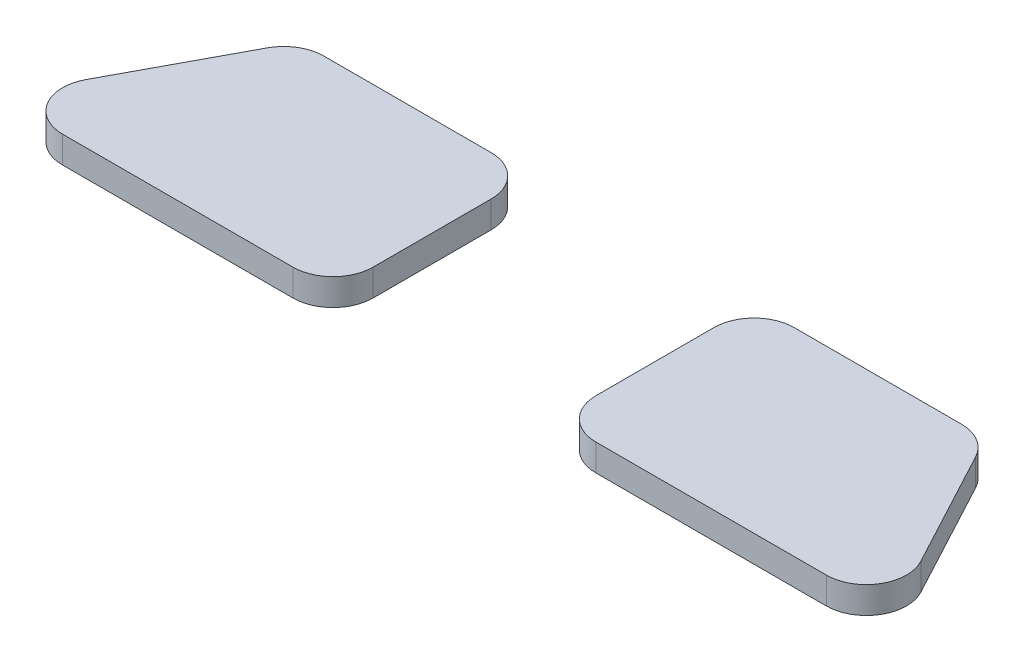
ISO-10303-21;
HEADER;
FILE_DESCRIPTION(('STEP AP214'),'2;1');
FILE_NAME('part.step','',(''),(''),'','','');
FILE_SCHEMA(('AUTOMOTIVE_DESIGN { 1 0 10303 214 1 1 1 1 }'));
ENDSEC;
DATA;
#1=APPLICATION_CONTEXT('core data for automotive mechanical design processes');
#2=APPLICATION_PROTOCOL_DEFINITION('international standard','automotive_design',2000,#1);
#3=PRODUCT_CONTEXT('',#1,'mechanical');
#4=PRODUCT('Part','Part','',(#3));
#5=PRODUCT_RELATED_PRODUCT_CATEGORY('part','',(#4));
#6=PRODUCT_DEFINITION_FORMATION('','',#4);
#7=PRODUCT_DEFINITION_CONTEXT('part definition',#1,'design');
#8=PRODUCT_DEFINITION('design','',#6,#7);
#9=PRODUCT_DEFINITION_SHAPE('','',#8);
#10=(LENGTH_UNIT() NAMED_UNIT(*) SI_UNIT(.MILLI.,.METRE.));
#11=(NAMED_UNIT(*) PLANE_ANGLE_UNIT() SI_UNIT($,.RADIAN.));
#12=(NAMED_UNIT(*) SI_UNIT($,.STERADIAN.) SOLID_ANGLE_UNIT());
#13=UNCERTAINTY_MEASURE_WITH_UNIT(LENGTH_MEASURE(1.E-05),#10,'distance_accuracy_value','');
#14=(GEOMETRIC_REPRESENTATION_CONTEXT(3) GLOBAL_UNCERTAINTY_ASSIGNED_CONTEXT((#13)) GLOBAL_UNIT_ASSIGNED_CONTEXT((#10,
#11,#12)) REPRESENTATION_CONTEXT('',''));
#15=CARTESIAN_POINT('',(0.,0.,0.));
#16=DIRECTION('',(0.,0.,1.));
#17=DIRECTION('',(1.,0.,0.));
#18=AXIS2_PLACEMENT_3D('',#15,#16,#17);
#19=CARTESIAN_POINT('',(36.9297716522194,2.,3.));
#20=DIRECTION('',(0.,-1.,0.));
#21=DIRECTION('',(0.,0.,-1.));
#22=AXIS2_PLACEMENT_3D('',#19,#20,#21);
#23=CYLINDRICAL_SURFACE('',#22,3.);
#24=CARTESIAN_POINT('',(36.9297716522194,0.,3.));
#25=DIRECTION('',(0.,1.,0.));
#26=DIRECTION('',(0.,0.,1.));
#27=AXIS2_PLACEMENT_3D('',#24,#25,#26);
#28=CIRCLE('',#27,3.);
#29=CARTESIAN_POINT('',(36.9297716522194,0.,0.));
#30=VERTEX_POINT('',#29);
#31=CARTESIAN_POINT('',(33.9297716522194,0.,3.00000000000002));
#32=VERTEX_POINT('',#31);
#33=EDGE_CURVE('E12',#30,#32,#28,.T.);
#34=ORIENTED_EDGE('',*,*,#33,.T.);
#35=DIRECTION('',(0.,-1.,0.));
#36=VECTOR('',#35,1.);
#37=CARTESIAN_POINT('',(33.9297716522194,2.,3.00000000000002));
#38=LINE('',#37,#36);
#39=CARTESIAN_POINT('',(33.9297716522194,2.,3.00000000000002));
#40=VERTEX_POINT('',#39);
#41=EDGE_CURVE('E185',#40,#32,#38,.T.);
#42=ORIENTED_EDGE('',*,*,#41,.F.);
#43=CARTESIAN_POINT('',(36.9297716522194,2.,3.));
#44=DIRECTION('',(0.,1.,0.));
#45=DIRECTION('',(0.,0.,1.));
#46=AXIS2_PLACEMENT_3D('',#43,#44,#45);
#47=CIRCLE('',#46,3.);
#48=CARTESIAN_POINT('',(36.9297716522194,2.,0.));
#49=VERTEX_POINT('',#48);
#50=EDGE_CURVE('E53',#49,#40,#47,.T.);
#51=ORIENTED_EDGE('',*,*,#50,.F.);
#52=DIRECTION('',(0.,-1.,0.));
#53=VECTOR('',#52,1.);
#54=CARTESIAN_POINT('',(36.9297716522194,2.,0.));
#55=LINE('',#54,#53);
#56=EDGE_CURVE('E153',#49,#30,#55,.T.);
#57=ORIENTED_EDGE('',*,*,#56,.T.);
#58=EDGE_LOOP('',(#34,#42,#51,#57));
#59=FACE_BOUND('',#58,.T.);
#60=ADVANCED_FACE('F49',(#59),#23,.T.);
#61=CARTESIAN_POINT('',(33.9297716522194,2.,3.00000000000002));
#62=DIRECTION('',(1.,0.,0.));
#63=DIRECTION('',(0.,0.,-1.));
#64=AXIS2_PLACEMENT_3D('',#61,#62,#63);
#65=PLANE('',#64);
#66=DIRECTION('',(0.,0.,1.));
#67=VECTOR('',#66,1.);
#68=CARTESIAN_POINT('',(33.9297716522194,0.,3.00000000000002));
#69=LINE('',#68,#67);
#70=CARTESIAN_POINT('',(33.9297716522194,0.,11.81));
#71=VERTEX_POINT('',#70);
#72=EDGE_CURVE('E59',#32,#71,#69,.T.);
#73=ORIENTED_EDGE('',*,*,#72,.T.);
#74=DIRECTION('',(0.,-1.,0.));
#75=VECTOR('',#74,1.);
#76=CARTESIAN_POINT('',(33.9297716522194,2.,11.81));
#77=LINE('',#76,#75);
#78=CARTESIAN_POINT('',(33.9297716522194,2.,11.81));
#79=VERTEX_POINT('',#78);
#80=EDGE_CURVE('E129',#79,#71,#77,.T.);
#81=ORIENTED_EDGE('',*,*,#80,.F.);
#82=DIRECTION('',(0.,0.,1.));
#83=VECTOR('',#82,1.);
#84=CARTESIAN_POINT('',(33.9297716522194,2.,3.00000000000002));
#85=LINE('',#84,#83);
#86=EDGE_CURVE('E95',#40,#79,#85,.T.);
#87=ORIENTED_EDGE('',*,*,#86,.F.);
#88=ORIENTED_EDGE('',*,*,#41,.T.);
#89=EDGE_LOOP('',(#73,#81,#87,#88));
#90=FACE_BOUND('',#89,.T.);
#91=ADVANCED_FACE('F191',(#90),#65,.F.);
#92=CARTESIAN_POINT('',(36.9297716522194,2.,11.81));
#93=DIRECTION('',(0.,-1.,0.));
#94=DIRECTION('',(0.,0.,-1.));
#95=AXIS2_PLACEMENT_3D('',#92,#93,#94);
#96=CYLINDRICAL_SURFACE('',#95,3.);
#97=CARTESIAN_POINT('',(36.9297716522194,0.,11.81));
#98=DIRECTION('',(0.,1.,0.));
#99=DIRECTION('',(0.,0.,1.));
#100=AXIS2_PLACEMENT_3D('',#97,#98,#99);
#101=CIRCLE('',#100,3.);
#102=CARTESIAN_POINT('',(36.9297716522194,0.,14.81));
#103=VERTEX_POINT('',#102);
#104=EDGE_CURVE('E123',#71,#103,#101,.T.);
#105=ORIENTED_EDGE('',*,*,#104,.T.);
#106=DIRECTION('',(0.,-1.,0.));
#107=VECTOR('',#106,1.);
#108=CARTESIAN_POINT('',(36.9297716522194,2.,14.81));
#109=LINE('',#108,#107);
#110=CARTESIAN_POINT('',(36.9297716522194,2.,14.81));
#111=VERTEX_POINT('',#110);
#112=EDGE_CURVE('E127',#111,#103,#109,.T.);
#113=ORIENTED_EDGE('',*,*,#112,.F.);
#114=CARTESIAN_POINT('',(36.9297716522194,2.,11.81));
#115=DIRECTION('',(0.,1.,0.));
#116=DIRECTION('',(0.,0.,1.));
#117=AXIS2_PLACEMENT_3D('',#114,#115,#116);
#118=CIRCLE('',#117,3.);
#119=EDGE_CURVE('E160',#79,#111,#118,.T.);
#120=ORIENTED_EDGE('',*,*,#119,.F.);
#121=ORIENTED_EDGE('',*,*,#80,.T.);
#122=EDGE_LOOP('',(#105,#113,#120,#121));
#123=FACE_BOUND('',#122,.T.);
#124=ADVANCED_FACE('F125',(#123),#96,.T.);
#125=CARTESIAN_POINT('',(36.9297716522194,2.,14.81));
#126=DIRECTION('',(0.,0.,-1.));
#127=DIRECTION('',(-1.,0.,0.));
#128=AXIS2_PLACEMENT_3D('',#125,#126,#127);
#129=PLANE('',#128);
#130=DIRECTION('',(1.,0.,0.));
#131=VECTOR('',#130,1.);
#132=CARTESIAN_POINT('',(36.9297716522194,0.,14.81));
#133=LINE('',#132,#131);
#134=CARTESIAN_POINT('',(54.1334145088564,0.,14.81));
#135=VERTEX_POINT('',#134);
#136=EDGE_CURVE('E131',#103,#135,#133,.T.);
#137=ORIENTED_EDGE('',*,*,#136,.T.);
#138=DIRECTION('',(0.,-1.,0.));
#139=VECTOR('',#138,1.);
#140=CARTESIAN_POINT('',(54.1334145088564,2.,14.81));
#141=LINE('',#140,#139);
#142=CARTESIAN_POINT('',(54.1334145088564,2.,14.81));
#143=VERTEX_POINT('',#142);
#144=EDGE_CURVE('E138',#143,#135,#141,.T.);
#145=ORIENTED_EDGE('',*,*,#144,.F.);
#146=DIRECTION('',(1.,0.,0.));
#147=VECTOR('',#146,1.);
#148=CARTESIAN_POINT('',(36.9297716522194,2.,14.81));
#149=LINE('',#148,#147);
#150=EDGE_CURVE('E137',#111,#143,#149,.T.);
#151=ORIENTED_EDGE('',*,*,#150,.F.);
#152=ORIENTED_EDGE('',*,*,#112,.T.);
#153=EDGE_LOOP('',(#137,#145,#151,#152));
#154=FACE_BOUND('',#153,.T.);
#155=ADVANCED_FACE('F134',(#154),#129,.F.);
#156=CARTESIAN_POINT('',(54.1334145088564,2.,11.81));
#157=DIRECTION('',(0.,-1.,0.));
#158=DIRECTION('',(0.,0.,-1.));
#159=AXIS2_PLACEMENT_3D('',#156,#157,#158);
#160=CYLINDRICAL_SURFACE('',#159,3.);
#161=CARTESIAN_POINT('',(54.1334145088564,0.,11.81));
#162=DIRECTION('',(0.,1.,0.));
#163=DIRECTION('',(0.,0.,1.));
#164=AXIS2_PLACEMENT_3D('',#161,#162,#163);
#165=CIRCLE('',#164,3.);
#166=CARTESIAN_POINT('',(56.7788893629486,0.,10.3952693555429));
#167=VERTEX_POINT('',#166);
#168=EDGE_CURVE('E143',#135,#167,#165,.T.);
#169=ORIENTED_EDGE('',*,*,#168,.T.);
#170=DIRECTION('',(0.,-1.,0.));
#171=VECTOR('',#170,1.);
#172=CARTESIAN_POINT('',(56.7788893629486,2.,10.3952693555429));
#173=LINE('',#172,#171);
#174=CARTESIAN_POINT('',(56.7788893629486,2.,10.3952693555429));
#175=VERTEX_POINT('',#174);
#176=EDGE_CURVE('E177',#175,#167,#173,.T.);
#177=ORIENTED_EDGE('',*,*,#176,.F.);
#178=CARTESIAN_POINT('',(54.1334145088564,2.,11.81));
#179=DIRECTION('',(0.,1.,0.));
#180=DIRECTION('',(0.,0.,1.));
#181=AXIS2_PLACEMENT_3D('',#178,#179,#180);
#182=CIRCLE('',#181,3.);
#183=EDGE_CURVE('E157',#143,#175,#182,.T.);
#184=ORIENTED_EDGE('',*,*,#183,.F.);
#185=ORIENTED_EDGE('',*,*,#144,.T.);
#186=EDGE_LOOP('',(#169,#177,#184,#185));
#187=FACE_BOUND('',#186,.T.);
#188=ADVANCED_FACE('F194',(#187),#160,.T.);
#189=CARTESIAN_POINT('',(52.0675321718615,2.,1.58526935554289));
#190=DIRECTION('',(-0.881824951364054,0.,0.471576881485706));
#191=DIRECTION('',(0.471576881485706,0.,0.881824951364054));
#192=AXIS2_PLACEMENT_3D('',#189,#190,#191);
#193=PLANE('',#192);
#194=DIRECTION('',(-0.471576881485706,0.,-0.881824951364054));
#195=VECTOR('',#194,1.);
#196=CARTESIAN_POINT('',(52.0675321718615,0.,1.58526935554289));
#197=LINE('',#196,#195);
#198=CARTESIAN_POINT('',(52.0675321718615,0.,1.58526935554289));
#199=VERTEX_POINT('',#198);
#200=EDGE_CURVE('E145',#167,#199,#197,.T.);
#201=ORIENTED_EDGE('',*,*,#200,.T.);
#202=DIRECTION('',(0.,-1.,0.));
#203=VECTOR('',#202,1.);
#204=CARTESIAN_POINT('',(52.0675321718615,2.,1.58526935554289));
#205=LINE('',#204,#203);
#206=CARTESIAN_POINT('',(52.0675321718615,2.,1.58526935554289));
#207=VERTEX_POINT('',#206);
#208=EDGE_CURVE('E174',#207,#199,#205,.T.);
#209=ORIENTED_EDGE('',*,*,#208,.F.);
#210=DIRECTION('',(-0.471576881485706,0.,-0.881824951364054));
#211=VECTOR('',#210,1.);
#212=CARTESIAN_POINT('',(52.0675321718615,2.,1.58526935554289));
#213=LINE('',#212,#211);
#214=EDGE_CURVE('E155',#175,#207,#213,.T.);
#215=ORIENTED_EDGE('',*,*,#214,.F.);
#216=ORIENTED_EDGE('',*,*,#176,.T.);
#217=EDGE_LOOP('',(#201,#209,#215,#216));
#218=FACE_BOUND('',#217,.T.);
#219=ADVANCED_FACE('F172',(#218),#193,.F.);
#220=CARTESIAN_POINT('',(49.4220573177693,2.,3.));
#221=DIRECTION('',(0.,-1.,0.));
#222=DIRECTION('',(0.,0.,-1.));
#223=AXIS2_PLACEMENT_3D('',#220,#221,#222);
#224=CYLINDRICAL_SURFACE('',#223,3.);
#225=CARTESIAN_POINT('',(49.4220573177693,0.,3.));
#226=DIRECTION('',(0.,1.,0.));
#227=DIRECTION('',(0.,0.,-1.));
#228=AXIS2_PLACEMENT_3D('',#225,#226,#227);
#229=CIRCLE('',#228,3.);
#230=CARTESIAN_POINT('',(49.4220573177693,0.,0.));
#231=VERTEX_POINT('',#230);
#232=EDGE_CURVE('E163',#199,#231,#229,.T.);
#233=ORIENTED_EDGE('',*,*,#232,.T.);
#234=DIRECTION('',(0.,-1.,0.));
#235=VECTOR('',#234,1.);
#236=CARTESIAN_POINT('',(49.4220573177693,2.,0.));
#237=LINE('',#236,#235);
#238=CARTESIAN_POINT('',(49.4220573177693,2.,0.));
#239=VERTEX_POINT('',#238);
#240=EDGE_CURVE('E182',#239,#231,#237,.T.);
#241=ORIENTED_EDGE('',*,*,#240,.F.);
#242=CARTESIAN_POINT('',(49.4220573177693,2.,3.));
#243=DIRECTION('',(0.,1.,0.));
#244=DIRECTION('',(0.,0.,-1.));
#245=AXIS2_PLACEMENT_3D('',#242,#243,#244);
#246=CIRCLE('',#245,3.);
#247=EDGE_CURVE('E152',#207,#239,#246,.T.);
#248=ORIENTED_EDGE('',*,*,#247,.F.);
#249=ORIENTED_EDGE('',*,*,#208,.T.);
#250=EDGE_LOOP('',(#233,#241,#248,#249));
#251=FACE_BOUND('',#250,.T.);
#252=ADVANCED_FACE('F180',(#251),#224,.T.);
#253=CARTESIAN_POINT('',(49.4220573177693,2.,0.));
#254=DIRECTION('',(0.,0.,1.));
#255=DIRECTION('',(1.,0.,0.));
#256=AXIS2_PLACEMENT_3D('',#253,#254,#255);
#257=PLANE('',#256);
#258=DIRECTION('',(-1.,0.,0.));
#259=VECTOR('',#258,1.);
#260=CARTESIAN_POINT('',(49.4220573177693,0.,0.));
#261=LINE('',#260,#259);
#262=EDGE_CURVE('E106',#231,#30,#261,.T.);
#263=ORIENTED_EDGE('',*,*,#262,.T.);
#264=ORIENTED_EDGE('',*,*,#56,.F.);
#265=DIRECTION('',(-1.,0.,0.));
#266=VECTOR('',#265,1.);
#267=CARTESIAN_POINT('',(49.4220573177693,2.,0.));
#268=LINE('',#267,#266);
#269=EDGE_CURVE('E150',#239,#49,#268,.T.);
#270=ORIENTED_EDGE('',*,*,#269,.F.);
#271=ORIENTED_EDGE('',*,*,#240,.T.);
#272=EDGE_LOOP('',(#263,#264,#270,#271));
#273=FACE_BOUND('',#272,.T.);
#274=ADVANCED_FACE('F195',(#273),#257,.F.);
#275=CARTESIAN_POINT('',(36.9297716522194,2.,3.));
#276=DIRECTION('',(0.,1.,0.));
#277=DIRECTION('',(0.,0.,1.));
#278=AXIS2_PLACEMENT_3D('',#275,#276,#277);
#279=PLANE('',#278);
#280=ORIENTED_EDGE('',*,*,#50,.T.);
#281=ORIENTED_EDGE('',*,*,#86,.T.);
#282=ORIENTED_EDGE('',*,*,#119,.T.);
#283=ORIENTED_EDGE('',*,*,#150,.T.);
#284=ORIENTED_EDGE('',*,*,#183,.T.);
#285=ORIENTED_EDGE('',*,*,#214,.T.);
#286=ORIENTED_EDGE('',*,*,#247,.T.);
#287=ORIENTED_EDGE('',*,*,#269,.T.);
#288=EDGE_LOOP('',(#280,#281,#282,#283,#284,#285,#286,#287));
#289=FACE_BOUND('',#288,.T.);
#290=ADVANCED_FACE('F51',(#289),#279,.T.);
#291=CARTESIAN_POINT('',(36.9297716522194,0.,3.));
#292=DIRECTION('',(0.,1.,0.));
#293=DIRECTION('',(0.,0.,1.));
#294=AXIS2_PLACEMENT_3D('',#291,#292,#293);
#295=PLANE('',#294);
#296=ORIENTED_EDGE('',*,*,#33,.F.);
#297=ORIENTED_EDGE('',*,*,#262,.F.);
#298=ORIENTED_EDGE('',*,*,#232,.F.);
#299=ORIENTED_EDGE('',*,*,#200,.F.);
#300=ORIENTED_EDGE('',*,*,#168,.F.);
#301=ORIENTED_EDGE('',*,*,#136,.F.);
#302=ORIENTED_EDGE('',*,*,#104,.F.);
#303=ORIENTED_EDGE('',*,*,#72,.F.);
#304=EDGE_LOOP('',(#296,#297,#298,#299,#300,#301,#302,#303));
#305=FACE_BOUND('',#304,.T.);
#306=ADVANCED_FACE('F141',(#305),#295,.F.);
#307=CLOSED_SHELL('',(#60,#91,#124,#155,#188,#219,#252,#274,#290,#306));
#308=MANIFOLD_SOLID_BREP('B2',#307);
#309=CARTESIAN_POINT('',(-2.91364285663705,2.,11.81));
#310=DIRECTION('',(0.,-1.,0.));
#311=DIRECTION('',(0.,0.,-1.));
#312=AXIS2_PLACEMENT_3D('',#309,#310,#311);
#313=CYLINDRICAL_SURFACE('',#312,3.);
#314=CARTESIAN_POINT('',(-2.91364285663705,0.,11.81));
#315=DIRECTION('',(0.,1.,0.));
#316=DIRECTION('',(0.,0.,-1.));
#317=AXIS2_PLACEMENT_3D('',#314,#315,#316);
#318=CIRCLE('',#317,3.);
#319=CARTESIAN_POINT('',(-5.55911771072919,0.,10.3952693555429));
#320=VERTEX_POINT('',#319);
#321=CARTESIAN_POINT('',(-2.91364285663701,0.,14.81));
#322=VERTEX_POINT('',#321);
#323=EDGE_CURVE('E393',#320,#322,#318,.T.);
#324=ORIENTED_EDGE('',*,*,#323,.T.);
#325=DIRECTION('',(0.,-1.,0.));
#326=VECTOR('',#325,1.);
#327=CARTESIAN_POINT('',(-2.91364285663701,2.,14.81));
#328=LINE('',#327,#326);
#329=CARTESIAN_POINT('',(-2.91364285663701,2.,14.81));
#330=VERTEX_POINT('',#329);
#331=EDGE_CURVE('E47',#330,#322,#328,.T.);
#332=ORIENTED_EDGE('',*,*,#331,.F.);
#333=CARTESIAN_POINT('',(-2.91364285663705,2.,11.81));
#334=DIRECTION('',(0.,1.,0.));
#335=DIRECTION('',(0.,0.,-1.));
#336=AXIS2_PLACEMENT_3D('',#333,#334,#335);
#337=CIRCLE('',#336,3.);
#338=CARTESIAN_POINT('',(-5.55911771072919,2.,10.3952693555429));
#339=VERTEX_POINT('',#338);
#340=EDGE_CURVE('E407',#339,#330,#337,.T.);
#341=ORIENTED_EDGE('',*,*,#340,.F.);
#342=DIRECTION('',(0.,-1.,0.));
#343=VECTOR('',#342,1.);
#344=CARTESIAN_POINT('',(-5.55911771072919,2.,10.3952693555429));
#345=LINE('',#344,#343);
#346=EDGE_CURVE('E389',#339,#320,#345,.T.);
#347=ORIENTED_EDGE('',*,*,#346,.T.);
#348=EDGE_LOOP('',(#324,#332,#341,#347));
#349=FACE_BOUND('',#348,.T.);
#350=ADVANCED_FACE('F297',(#349),#313,.T.);
#351=CARTESIAN_POINT('',(14.29,2.,14.81));
#352=DIRECTION('',(0.,0.,-1.));
#353=DIRECTION('',(-1.,0.,0.));
#354=AXIS2_PLACEMENT_3D('',#351,#352,#353);
#355=PLANE('',#354);
#356=DIRECTION('',(1.,0.,0.));
#357=VECTOR('',#356,1.);
#358=CARTESIAN_POINT('',(14.29,0.,14.81));
#359=LINE('',#358,#357);
#360=CARTESIAN_POINT('',(14.29,0.,14.81));
#361=VERTEX_POINT('',#360);
#362=EDGE_CURVE('E396',#322,#361,#359,.T.);
#363=ORIENTED_EDGE('',*,*,#362,.T.);
#364=DIRECTION('',(0.,-1.,0.));
#365=VECTOR('',#364,1.);
#366=CARTESIAN_POINT('',(14.29,2.,14.81));
#367=LINE('',#366,#365);
#368=CARTESIAN_POINT('',(14.29,2.,14.81));
#369=VERTEX_POINT('',#368);
#370=EDGE_CURVE('E305',#369,#361,#367,.T.);
#371=ORIENTED_EDGE('',*,*,#370,.F.);
#372=DIRECTION('',(1.,0.,0.));
#373=VECTOR('',#372,1.);
#374=CARTESIAN_POINT('',(14.29,2.,14.81));
#375=LINE('',#374,#373);
#376=EDGE_CURVE('E356',#330,#369,#375,.T.);
#377=ORIENTED_EDGE('',*,*,#376,.F.);
#378=ORIENTED_EDGE('',*,*,#331,.T.);
#379=EDGE_LOOP('',(#363,#371,#377,#378));
#380=FACE_BOUND('',#379,.T.);
#381=ADVANCED_FACE('F442',(#380),#355,.F.);
#382=CARTESIAN_POINT('',(14.29,2.,11.81));
#383=DIRECTION('',(0.,-1.,0.));
#384=DIRECTION('',(0.,0.,-1.));
#385=AXIS2_PLACEMENT_3D('',#382,#383,#384);
#386=CYLINDRICAL_SURFACE('',#385,3.);
#387=CARTESIAN_POINT('',(14.29,0.,11.81));
#388=DIRECTION('',(0.,1.,0.));
#389=DIRECTION('',(0.,0.,-1.));
#390=AXIS2_PLACEMENT_3D('',#387,#388,#389);
#391=CIRCLE('',#390,3.);
#392=CARTESIAN_POINT('',(17.29,0.,11.81));
#393=VERTEX_POINT('',#392);
#394=EDGE_CURVE('E398',#361,#393,#391,.T.);
#395=ORIENTED_EDGE('',*,*,#394,.T.);
#396=DIRECTION('',(0.,-1.,0.));
#397=VECTOR('',#396,1.);
#398=CARTESIAN_POINT('',(17.29,2.,11.81));
#399=LINE('',#398,#397);
#400=CARTESIAN_POINT('',(17.29,2.,11.81));
#401=VERTEX_POINT('',#400);
#402=EDGE_CURVE('E414',#401,#393,#399,.T.);
#403=ORIENTED_EDGE('',*,*,#402,.F.);
#404=CARTESIAN_POINT('',(14.29,2.,11.81));
#405=DIRECTION('',(0.,1.,0.));
#406=DIRECTION('',(0.,0.,-1.));
#407=AXIS2_PLACEMENT_3D('',#404,#405,#406);
#408=CIRCLE('',#407,3.);
#409=EDGE_CURVE('E422',#369,#401,#408,.T.);
#410=ORIENTED_EDGE('',*,*,#409,.F.);
#411=ORIENTED_EDGE('',*,*,#370,.T.);
#412=EDGE_LOOP('',(#395,#403,#410,#411));
#413=FACE_BOUND('',#412,.T.);
#414=ADVANCED_FACE('F420',(#413),#386,.T.);
#415=CARTESIAN_POINT('',(17.29,2.,3.00000000000002));
#416=DIRECTION('',(-1.,0.,0.));
#417=DIRECTION('',(0.,0.,1.));
#418=AXIS2_PLACEMENT_3D('',#415,#416,#417);
#419=PLANE('',#418);
#420=DIRECTION('',(0.,0.,-1.));
#421=VECTOR('',#420,1.);
#422=CARTESIAN_POINT('',(17.29,0.,3.00000000000002));
#423=LINE('',#422,#421);
#424=CARTESIAN_POINT('',(17.29,0.,3.00000000000002));
#425=VERTEX_POINT('',#424);
#426=EDGE_CURVE('E400',#393,#425,#423,.T.);
#427=ORIENTED_EDGE('',*,*,#426,.T.);
#428=DIRECTION('',(0.,-1.,0.));
#429=VECTOR('',#428,1.);
#430=CARTESIAN_POINT('',(17.29,2.,3.00000000000002));
#431=LINE('',#430,#429);
#432=CARTESIAN_POINT('',(17.29,2.,3.00000000000002));
#433=VERTEX_POINT('',#432);
#434=EDGE_CURVE('E411',#433,#425,#431,.T.);
#435=ORIENTED_EDGE('',*,*,#434,.F.);
#436=DIRECTION('',(0.,0.,-1.));
#437=VECTOR('',#436,1.);
#438=CARTESIAN_POINT('',(17.29,2.,3.00000000000002));
#439=LINE('',#438,#437);
#440=EDGE_CURVE('E434',#401,#433,#439,.T.);
#441=ORIENTED_EDGE('',*,*,#440,.F.);
#442=ORIENTED_EDGE('',*,*,#402,.T.);
#443=EDGE_LOOP('',(#427,#435,#441,#442));
#444=FACE_BOUND('',#443,.T.);
#445=ADVANCED_FACE('F430',(#444),#419,.F.);
#446=CARTESIAN_POINT('',(14.29,2.,3.));
#447=DIRECTION('',(0.,-1.,0.));
#448=DIRECTION('',(0.,0.,-1.));
#449=AXIS2_PLACEMENT_3D('',#446,#447,#448);
#450=CYLINDRICAL_SURFACE('',#449,3.);
#451=CARTESIAN_POINT('',(14.29,0.,3.));
#452=DIRECTION('',(0.,1.,0.));
#453=DIRECTION('',(0.,0.,-1.));
#454=AXIS2_PLACEMENT_3D('',#451,#452,#453);
#455=CIRCLE('',#454,3.);
#456=CARTESIAN_POINT('',(14.29,0.,0.));
#457=VERTEX_POINT('',#456);
#458=EDGE_CURVE('E402',#425,#457,#455,.T.);
#459=ORIENTED_EDGE('',*,*,#458,.T.);
#460=DIRECTION('',(0.,-1.,0.));
#461=VECTOR('',#460,1.);
#462=CARTESIAN_POINT('',(14.29,2.,0.));
#463=LINE('',#462,#461);
#464=CARTESIAN_POINT('',(14.29,2.,0.));
#465=VERTEX_POINT('',#464);
#466=EDGE_CURVE('E384',#465,#457,#463,.T.);
#467=ORIENTED_EDGE('',*,*,#466,.F.);
#468=CARTESIAN_POINT('',(14.29,2.,3.));
#469=DIRECTION('',(0.,1.,0.));
#470=DIRECTION('',(0.,0.,-1.));
#471=AXIS2_PLACEMENT_3D('',#468,#469,#470);
#472=CIRCLE('',#471,3.);
#473=EDGE_CURVE('E375',#433,#465,#472,.T.);
#474=ORIENTED_EDGE('',*,*,#473,.F.);
#475=ORIENTED_EDGE('',*,*,#434,.T.);
#476=EDGE_LOOP('',(#459,#467,#474,#475));
#477=FACE_BOUND('',#476,.T.);
#478=ADVANCED_FACE('F433',(#477),#450,.T.);
#479=CARTESIAN_POINT('',(1.79771433445007,2.,0.));
#480=DIRECTION('',(0.,0.,1.));
#481=DIRECTION('',(1.,0.,0.));
#482=AXIS2_PLACEMENT_3D('',#479,#480,#481);
#483=PLANE('',#482);
#484=DIRECTION('',(-1.,0.,0.));
#485=VECTOR('',#484,1.);
#486=CARTESIAN_POINT('',(1.79771433445007,0.,0.));
#487=LINE('',#486,#485);
#488=CARTESIAN_POINT('',(1.79771433445007,0.,0.));
#489=VERTEX_POINT('',#488);
#490=EDGE_CURVE('E383',#457,#489,#487,.T.);
#491=ORIENTED_EDGE('',*,*,#490,.T.);
#492=DIRECTION('',(0.,-1.,0.));
#493=VECTOR('',#492,1.);
#494=CARTESIAN_POINT('',(1.79771433445007,2.,0.));
#495=LINE('',#494,#493);
#496=CARTESIAN_POINT('',(1.79771433445007,2.,0.));
#497=VERTEX_POINT('',#496);
#498=EDGE_CURVE('E380',#497,#489,#495,.T.);
#499=ORIENTED_EDGE('',*,*,#498,.F.);
#500=DIRECTION('',(-1.,0.,0.));
#501=VECTOR('',#500,1.);
#502=CARTESIAN_POINT('',(1.79771433445007,2.,0.));
#503=LINE('',#502,#501);
#504=EDGE_CURVE('E369',#465,#497,#503,.T.);
#505=ORIENTED_EDGE('',*,*,#504,.F.);
#506=ORIENTED_EDGE('',*,*,#466,.T.);
#507=EDGE_LOOP('',(#491,#499,#505,#506));
#508=FACE_BOUND('',#507,.T.);
#509=ADVANCED_FACE('F381',(#508),#483,.F.);
#510=CARTESIAN_POINT('',(1.79771433445005,2.,3.));
#511=DIRECTION('',(0.,-1.,0.));
#512=DIRECTION('',(0.,0.,-1.));
#513=AXIS2_PLACEMENT_3D('',#510,#511,#512);
#514=CYLINDRICAL_SURFACE('',#513,3.);
#515=CARTESIAN_POINT('',(1.79771433445005,0.,3.));
#516=DIRECTION('',(0.,1.,0.));
#517=DIRECTION('',(0.,0.,1.));
#518=AXIS2_PLACEMENT_3D('',#515,#516,#517);
#519=CIRCLE('',#518,3.);
#520=CARTESIAN_POINT('',(-0.847760519642114,0.,1.58526935554289));
#521=VERTEX_POINT('',#520);
#522=EDGE_CURVE('E342',#489,#521,#519,.T.);
#523=ORIENTED_EDGE('',*,*,#522,.T.);
#524=DIRECTION('',(0.,-1.,0.));
#525=VECTOR('',#524,1.);
#526=CARTESIAN_POINT('',(-0.847760519642114,2.,1.58526935554289));
#527=LINE('',#526,#525);
#528=CARTESIAN_POINT('',(-0.847760519642114,2.,1.58526935554289));
#529=VERTEX_POINT('',#528);
#530=EDGE_CURVE('E385',#529,#521,#527,.T.);
#531=ORIENTED_EDGE('',*,*,#530,.F.);
#532=CARTESIAN_POINT('',(1.79771433445005,2.,3.));
#533=DIRECTION('',(0.,1.,0.));
#534=DIRECTION('',(0.,0.,1.));
#535=AXIS2_PLACEMENT_3D('',#532,#533,#534);
#536=CIRCLE('',#535,3.);
#537=EDGE_CURVE('E373',#497,#529,#536,.T.);
#538=ORIENTED_EDGE('',*,*,#537,.F.);
#539=ORIENTED_EDGE('',*,*,#498,.T.);
#540=EDGE_LOOP('',(#523,#531,#538,#539));
#541=FACE_BOUND('',#540,.T.);
#542=ADVANCED_FACE('F387',(#541),#514,.T.);
#543=CARTESIAN_POINT('',(-0.847760519642115,2.,1.58526935554289));
#544=DIRECTION('',(0.881824951364054,0.,0.471576881485706));
#545=DIRECTION('',(0.471576881485706,0.,-0.881824951364054));
#546=AXIS2_PLACEMENT_3D('',#543,#544,#545);
#547=PLANE('',#546);
#548=DIRECTION('',(-0.471576881485706,0.,0.881824951364054));
#549=VECTOR('',#548,1.);
#550=CARTESIAN_POINT('',(-0.847760519642115,0.,1.58526935554289));
#551=LINE('',#550,#549);
#552=EDGE_CURVE('E348',#521,#320,#551,.T.);
#553=ORIENTED_EDGE('',*,*,#552,.T.);
#554=ORIENTED_EDGE('',*,*,#346,.F.);
#555=DIRECTION('',(-0.471576881485706,0.,0.881824951364054));
#556=VECTOR('',#555,1.);
#557=CARTESIAN_POINT('',(-0.847760519642115,2.,1.58526935554289));
#558=LINE('',#557,#556);
#559=EDGE_CURVE('E313',#529,#339,#558,.T.);
#560=ORIENTED_EDGE('',*,*,#559,.F.);
#561=ORIENTED_EDGE('',*,*,#530,.T.);
#562=EDGE_LOOP('',(#553,#554,#560,#561));
#563=FACE_BOUND('',#562,.T.);
#564=ADVANCED_FACE('F458',(#563),#547,.F.);
#565=CARTESIAN_POINT('',(-2.91364285663705,2.,11.81));
#566=DIRECTION('',(0.,-1.,0.));
#567=DIRECTION('',(0.,0.,-1.));
#568=AXIS2_PLACEMENT_3D('',#565,#566,#567);
#569=PLANE('',#568);
#570=ORIENTED_EDGE('',*,*,#340,.T.);
#571=ORIENTED_EDGE('',*,*,#376,.T.);
#572=ORIENTED_EDGE('',*,*,#409,.T.);
#573=ORIENTED_EDGE('',*,*,#440,.T.);
#574=ORIENTED_EDGE('',*,*,#473,.T.);
#575=ORIENTED_EDGE('',*,*,#504,.T.);
#576=ORIENTED_EDGE('',*,*,#537,.T.);
#577=ORIENTED_EDGE('',*,*,#559,.T.);
#578=EDGE_LOOP('',(#570,#571,#572,#573,#574,#575,#576,#577));
#579=FACE_BOUND('',#578,.T.);
#580=ADVANCED_FACE('F371',(#579),#569,.F.);
#581=CARTESIAN_POINT('',(-2.91364285663705,0.,11.81));
#582=DIRECTION('',(0.,-1.,0.));
#583=DIRECTION('',(0.,0.,-1.));
#584=AXIS2_PLACEMENT_3D('',#581,#582,#583);
#585=PLANE('',#584);
#586=ORIENTED_EDGE('',*,*,#323,.F.);
#587=ORIENTED_EDGE('',*,*,#552,.F.);
#588=ORIENTED_EDGE('',*,*,#522,.F.);
#589=ORIENTED_EDGE('',*,*,#490,.F.);
#590=ORIENTED_EDGE('',*,*,#458,.F.);
#591=ORIENTED_EDGE('',*,*,#426,.F.);
#592=ORIENTED_EDGE('',*,*,#394,.F.);
#593=ORIENTED_EDGE('',*,*,#362,.F.);
#594=EDGE_LOOP('',(#586,#587,#588,#589,#590,#591,#592,#593));
#595=FACE_BOUND('',#594,.T.);
#596=ADVANCED_FACE('F426',(#595),#585,.T.);
#597=CLOSED_SHELL('',(#350,#381,#414,#445,#478,#509,#542,#564,#580,#596));
#598=MANIFOLD_SOLID_BREP('B6',#597);
#599=ADVANCED_BREP_SHAPE_REPRESENTATION('',(#18,#308,#598),#14);
#600=SHAPE_DEFINITION_REPRESENTATION(#9,#599);
ENDSEC;
END-ISO-10303-21;
